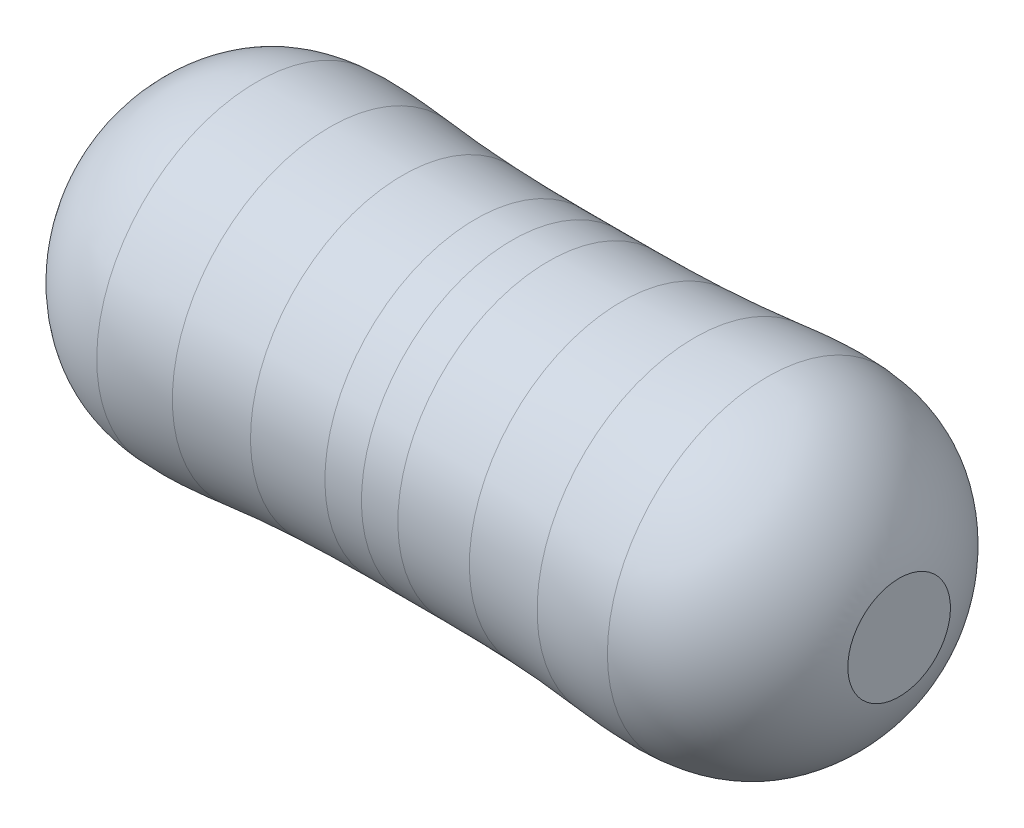
ISO-10303-21;
HEADER;
FILE_DESCRIPTION(('STEP AP214'),'2;1');
FILE_NAME('part.step','',(''),(''),'','','');
FILE_SCHEMA(('AUTOMOTIVE_DESIGN { 1 0 10303 214 1 1 1 1 }'));
ENDSEC;
DATA;
#1=APPLICATION_CONTEXT('core data for automotive mechanical design processes');
#2=APPLICATION_PROTOCOL_DEFINITION('international standard','automotive_design',2000,#1);
#3=PRODUCT_CONTEXT('',#1,'mechanical');
#4=PRODUCT('Part','Part','',(#3));
#5=PRODUCT_RELATED_PRODUCT_CATEGORY('part','',(#4));
#6=PRODUCT_DEFINITION_FORMATION('','',#4);
#7=PRODUCT_DEFINITION_CONTEXT('part definition',#1,'design');
#8=PRODUCT_DEFINITION('design','',#6,#7);
#9=PRODUCT_DEFINITION_SHAPE('','',#8);
#10=(LENGTH_UNIT() NAMED_UNIT(*) SI_UNIT(.MILLI.,.METRE.));
#11=(NAMED_UNIT(*) PLANE_ANGLE_UNIT() SI_UNIT($,.RADIAN.));
#12=(NAMED_UNIT(*) SI_UNIT($,.STERADIAN.) SOLID_ANGLE_UNIT());
#13=UNCERTAINTY_MEASURE_WITH_UNIT(LENGTH_MEASURE(1.E-05),#10,'distance_accuracy_value','');
#14=(GEOMETRIC_REPRESENTATION_CONTEXT(3) GLOBAL_UNCERTAINTY_ASSIGNED_CONTEXT((#13)) GLOBAL_UNIT_ASSIGNED_CONTEXT((#10,
#11,#12)) REPRESENTATION_CONTEXT('',''));
#15=CARTESIAN_POINT('',(0.,0.,0.));
#16=DIRECTION('',(0.,0.,1.));
#17=DIRECTION('',(1.,0.,0.));
#18=AXIS2_PLACEMENT_3D('',#15,#16,#17);
#19=CARTESIAN_POINT('',(9.34720000000025,1.77799999999992,-6.38378239159465E-13));
#20=CARTESIAN_POINT('',(9.35140151883764,1.87944243314242,-6.38378239159465E-13));
#21=CARTESIAN_POINT('',(9.37726000053859,2.50377553806516,-6.38378239159465E-13));
#22=CARTESIAN_POINT('',(8.5274821419799,3.71232146915156,6.93889390390723E-13));
#23=CARTESIAN_POINT('',(6.74831742350349,3.42818239547808,6.93889390390723E-13));
#24=CARTESIAN_POINT('',(5.63002600693799,3.42872222585712,6.93889390390723E-13));
#25=CARTESIAN_POINT('',(5.05459999999999,3.42900000000006,6.93889390390723E-13));
#26=B_SPLINE_CURVE_WITH_KNOTS('',3,(#19,#20,#21,#22,#23,#24,#25),.UNSPECIFIED.,.F.,.F.,(4,1,1,1,
4),(0.,0.0576904747940552,0.355059240367772,0.668140450217807,1.),.UNSPECIFIED.);
#27=CARTESIAN_POINT('',(9.34720000000025,1.77799999999992,-6.38378239159465E-13));
#28=DIRECTION('',(1.,0.,0.));
#29=AXIS1_PLACEMENT('',#27,#28);
#30=SURFACE_OF_REVOLUTION('',#26,#29);
#31=CARTESIAN_POINT('',(7.85460000000025,1.778,-6.38378239159465E-13));
#32=DIRECTION('',(-1.,0.,0.));
#33=DIRECTION('',(0.,-1.,0.));
#34=AXIS2_PLACEMENT_3D('',#31,#32,#33);
#35=CIRCLE('',#34,1.75368327505911);
#36=CARTESIAN_POINT('',(7.85460000000025,0.0243167249408939,-6.38378239159465E-13));
#37=VERTEX_POINT('',#36);
#38=EDGE_CURVE('E131',#37,#37,#35,.T.);
#39=ORIENTED_EDGE('',*,*,#38,.F.);
#40=EDGE_LOOP('',(#39));
#41=FACE_BOUND('',#40,.T.);
#42=CARTESIAN_POINT('',(9.30000000000042,1.77799999999992,-6.38378239159465E-13));
#43=DIRECTION('',(1.,0.,0.));
#44=DIRECTION('',(0.,1.,0.));
#45=AXIS2_PLACEMENT_3D('',#42,#43,#44);
#46=CIRCLE('',#45,0.562696063492192);
#47=CARTESIAN_POINT('',(9.30000000000042,2.34069606349211,-6.38378239159465E-13));
#48=VERTEX_POINT('',#47);
#49=EDGE_CURVE('E55',#48,#48,#46,.F.);
#50=ORIENTED_EDGE('',*,*,#49,.T.);
#51=EDGE_LOOP('',(#50));
#52=FACE_BOUND('',#51,.T.);
#53=ADVANCED_FACE('F50',(#41,#52),#30,.F.);
#54=CARTESIAN_POINT('',(0.762000000000249,1.77799999999992,-6.38378239159465E-13));
#55=CARTESIAN_POINT('',(0.75779848116285,1.87944243314242,-6.38378239159465E-13));
#56=CARTESIAN_POINT('',(0.731939999461653,2.50377553806508,-6.38378239159465E-13));
#57=CARTESIAN_POINT('',(1.58171785802058,3.71232146915162,6.93889390390723E-13));
#58=CARTESIAN_POINT('',(3.36088257649651,3.42818239547808,6.93889390390723E-13));
#59=CARTESIAN_POINT('',(4.47917399306202,3.42872222585727,6.93889390390723E-13));
#60=CARTESIAN_POINT('',(5.05460000000001,3.42900000000006,6.93889390390723E-13));
#61=B_SPLINE_CURVE_WITH_KNOTS('',3,(#54,#55,#56,#57,#58,#59,#60),.UNSPECIFIED.,.F.,.F.,(4,1,1,1,
4),(0.,0.0576904747940552,0.355059240367772,0.668140450217807,1.),.UNSPECIFIED.);
#62=CARTESIAN_POINT('',(0.762000000000249,1.77799999999992,-6.38378239159465E-13));
#63=DIRECTION('',(-1.,0.,0.));
#64=AXIS1_PLACEMENT('',#62,#63);
#65=SURFACE_OF_REVOLUTION('',#61,#64);
#66=CARTESIAN_POINT('',(0.800000000000245,1.77799999999992,-6.38378239159465E-13));
#67=DIRECTION('',(-1.,0.,0.));
#68=DIRECTION('',(0.,-1.,0.));
#69=AXIS2_PLACEMENT_3D('',#66,#67,#68);
#70=CIRCLE('',#69,0.528410644999216);
#71=CARTESIAN_POINT('',(0.800000000000245,1.2495893550007,-6.38378239159465E-13));
#72=VERTEX_POINT('',#71);
#73=EDGE_CURVE('E71',#72,#72,#70,.T.);
#74=ORIENTED_EDGE('',*,*,#73,.F.);
#75=EDGE_LOOP('',(#74));
#76=FACE_BOUND('',#75,.T.);
#77=CARTESIAN_POINT('',(2.25460000000025,1.77799999999984,-6.38378239159465E-13));
#78=DIRECTION('',(-1.,0.,0.));
#79=DIRECTION('',(0.,-1.,0.));
#80=AXIS2_PLACEMENT_3D('',#77,#78,#79);
#81=CIRCLE('',#80,1.75368327505911);
#82=CARTESIAN_POINT('',(2.25460000000025,0.0243167249407274,-6.38378239159465E-13));
#83=VERTEX_POINT('',#82);
#84=EDGE_CURVE('E12',#83,#83,#81,.T.);
#85=ORIENTED_EDGE('',*,*,#84,.T.);
#86=EDGE_LOOP('',(#85));
#87=FACE_BOUND('',#86,.T.);
#88=ADVANCED_FACE('F93',(#76,#87),#65,.F.);
#89=CARTESIAN_POINT('',(3.85460000000025,1.77799999999984,-6.38378239159465E-13));
#90=DIRECTION('',(-1.,0.,0.));
#91=DIRECTION('',(0.,-1.,0.));
#92=AXIS2_PLACEMENT_3D('',#89,#90,#91);
#93=CIRCLE('',#92,1.66739616248277);
#94=CARTESIAN_POINT('',(3.85460000000025,0.11060383751707,-6.38378239159465E-13));
#95=VERTEX_POINT('',#94);
#96=EDGE_CURVE('E68',#95,#95,#93,.T.);
#97=ORIENTED_EDGE('',*,*,#96,.T.);
#98=EDGE_LOOP('',(#97));
#99=FACE_BOUND('',#98,.T.);
#100=CARTESIAN_POINT('',(3.05460000000025,1.778,-6.38378239159465E-13));
#101=DIRECTION('',(-1.,0.,0.));
#102=DIRECTION('',(0.,-1.,0.));
#103=AXIS2_PLACEMENT_3D('',#100,#101,#102);
#104=CIRCLE('',#103,1.72453972160211);
#105=CARTESIAN_POINT('',(3.05460000000025,0.0534602783978926,-6.38378239159465E-13));
#106=VERTEX_POINT('',#105);
#107=EDGE_CURVE('E60',#106,#106,#104,.F.);
#108=ORIENTED_EDGE('',*,*,#107,.T.);
#109=EDGE_LOOP('',(#108));
#110=FACE_BOUND('',#109,.T.);
#111=ADVANCED_FACE('F99',(#99,#110),#65,.F.);
#112=ORIENTED_EDGE('',*,*,#84,.F.);
#113=EDGE_LOOP('',(#112));
#114=FACE_BOUND('',#113,.T.);
#115=ORIENTED_EDGE('',*,*,#107,.F.);
#116=EDGE_LOOP('',(#115));
#117=FACE_BOUND('',#116,.T.);
#118=ADVANCED_FACE('F158',(#114,#117),#65,.F.);
#119=CARTESIAN_POINT('',(5.05460000000026,1.77800000000006,-6.38378239159465E-13));
#120=DIRECTION('',(-1.,0.,0.));
#121=DIRECTION('',(0.,-1.,0.));
#122=AXIS2_PLACEMENT_3D('',#119,#120,#121);
#123=CIRCLE('',#122,1.651);
#124=CARTESIAN_POINT('',(5.05460000000026,0.127000000000057,-6.38378239159465E-13));
#125=VERTEX_POINT('',#124);
#126=EDGE_CURVE('E73',#125,#125,#123,.T.);
#127=ORIENTED_EDGE('',*,*,#126,.T.);
#128=EDGE_LOOP('',(#127));
#129=FACE_BOUND('',#128,.T.);
#130=CARTESIAN_POINT('',(4.65460000000024,1.77800000000004,-6.38378239159465E-13));
#131=DIRECTION('',(-1.,0.,0.));
#132=DIRECTION('',(0.,-1.,0.));
#133=AXIS2_PLACEMENT_3D('',#130,#131,#132);
#134=CIRCLE('',#133,1.65144785309043);
#135=CARTESIAN_POINT('',(4.65460000000024,0.126552146909612,-6.38378239159465E-13));
#136=VERTEX_POINT('',#135);
#137=EDGE_CURVE('E134',#136,#136,#134,.F.);
#138=ORIENTED_EDGE('',*,*,#137,.T.);
#139=EDGE_LOOP('',(#138));
#140=FACE_BOUND('',#139,.T.);
#141=ADVANCED_FACE('F154',(#129,#140),#65,.F.);
#142=ORIENTED_EDGE('',*,*,#96,.F.);
#143=EDGE_LOOP('',(#142));
#144=FACE_BOUND('',#143,.T.);
#145=ORIENTED_EDGE('',*,*,#137,.F.);
#146=EDGE_LOOP('',(#145));
#147=FACE_BOUND('',#146,.T.);
#148=ADVANCED_FACE('F52',(#144,#147),#65,.F.);
#149=CARTESIAN_POINT('',(6.25460000000025,1.77800000000004,-6.38378239159465E-13));
#150=DIRECTION('',(-1.,0.,0.));
#151=DIRECTION('',(0.,-1.,0.));
#152=AXIS2_PLACEMENT_3D('',#149,#150,#151);
#153=CIRCLE('',#152,1.66739616248277);
#154=CARTESIAN_POINT('',(6.25460000000025,0.110603837517278,-6.38378239159465E-13));
#155=VERTEX_POINT('',#154);
#156=EDGE_CURVE('E116',#155,#155,#153,.T.);
#157=ORIENTED_EDGE('',*,*,#156,.F.);
#158=EDGE_LOOP('',(#157));
#159=FACE_BOUND('',#158,.T.);
#160=CARTESIAN_POINT('',(7.05460000000024,1.77800000000006,-6.38378239159465E-13));
#161=DIRECTION('',(-1.,0.,0.));
#162=DIRECTION('',(0.,-1.,0.));
#163=AXIS2_PLACEMENT_3D('',#160,#161,#162);
#164=CIRCLE('',#163,1.72453972160211);
#165=CARTESIAN_POINT('',(7.05460000000024,0.0534602783979481,-6.38378239159465E-13));
#166=VERTEX_POINT('',#165);
#167=EDGE_CURVE('E125',#166,#166,#164,.F.);
#168=ORIENTED_EDGE('',*,*,#167,.F.);
#169=EDGE_LOOP('',(#168));
#170=FACE_BOUND('',#169,.T.);
#171=ADVANCED_FACE('F95',(#159,#170),#30,.F.);
#172=ORIENTED_EDGE('',*,*,#38,.T.);
#173=EDGE_LOOP('',(#172));
#174=FACE_BOUND('',#173,.T.);
#175=ORIENTED_EDGE('',*,*,#167,.T.);
#176=EDGE_LOOP('',(#175));
#177=FACE_BOUND('',#176,.T.);
#178=ADVANCED_FACE('F104',(#174,#177),#30,.F.);
#179=ORIENTED_EDGE('',*,*,#126,.F.);
#180=EDGE_LOOP('',(#179));
#181=FACE_BOUND('',#180,.T.);
#182=CARTESIAN_POINT('',(5.45460000000025,1.77800000000006,-6.38378239159465E-13));
#183=DIRECTION('',(-1.,0.,0.));
#184=DIRECTION('',(0.,-1.,0.));
#185=AXIS2_PLACEMENT_3D('',#182,#183,#184);
#186=CIRCLE('',#185,1.65144785309043);
#187=CARTESIAN_POINT('',(5.45460000000025,0.126552146909626,-6.38378239159465E-13));
#188=VERTEX_POINT('',#187);
#189=EDGE_CURVE('E77',#188,#188,#186,.F.);
#190=ORIENTED_EDGE('',*,*,#189,.F.);
#191=EDGE_LOOP('',(#190));
#192=FACE_BOUND('',#191,.T.);
#193=ADVANCED_FACE('F107',(#181,#192),#30,.F.);
#194=ORIENTED_EDGE('',*,*,#156,.T.);
#195=EDGE_LOOP('',(#194));
#196=FACE_BOUND('',#195,.T.);
#197=ORIENTED_EDGE('',*,*,#189,.T.);
#198=EDGE_LOOP('',(#197));
#199=FACE_BOUND('',#198,.T.);
#200=ADVANCED_FACE('F90',(#196,#199),#30,.F.);
#201=CARTESIAN_POINT('',(0.799999999999995,0.,0.));
#202=DIRECTION('',(1.,0.,0.));
#203=DIRECTION('',(0.,0.,-1.));
#204=AXIS2_PLACEMENT_3D('',#201,#202,#203);
#205=PLANE('',#204);
#206=ORIENTED_EDGE('',*,*,#73,.T.);
#207=EDGE_LOOP('',(#206));
#208=FACE_BOUND('',#207,.T.);
#209=ADVANCED_FACE('F85',(#208),#205,.F.);
#210=CARTESIAN_POINT('',(9.3,0.,0.));
#211=DIRECTION('',(1.,0.,0.));
#212=DIRECTION('',(0.,0.,-1.));
#213=AXIS2_PLACEMENT_3D('',#210,#211,#212);
#214=PLANE('',#213);
#215=ORIENTED_EDGE('',*,*,#49,.F.);
#216=EDGE_LOOP('',(#215));
#217=FACE_BOUND('',#216,.T.);
#218=ADVANCED_FACE('F83',(#217),#214,.T.);
#219=CLOSED_SHELL('',(#53,#88,#111,#118,#141,#148,#171,#178,#193,#200,#209,#218));
#220=MANIFOLD_SOLID_BREP('B2',#219);
#221=ADVANCED_BREP_SHAPE_REPRESENTATION('',(#18,#220),#14);
#222=SHAPE_DEFINITION_REPRESENTATION(#9,#221);
ENDSEC;
END-ISO-10303-21;
